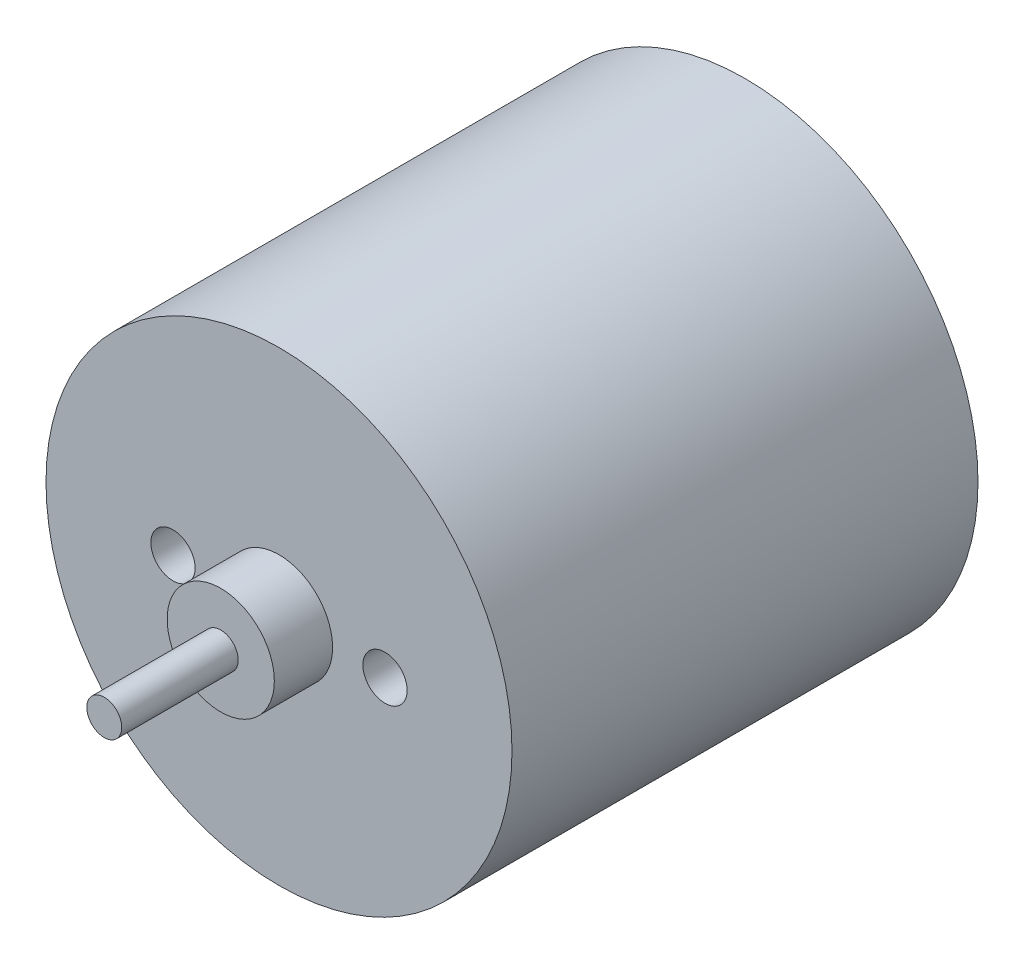
ISO-10303-21;
HEADER;
FILE_DESCRIPTION(('STEP AP214'),'2;1');
FILE_NAME('part.step','',(''),(''),'','','');
FILE_SCHEMA(('AUTOMOTIVE_DESIGN { 1 0 10303 214 1 1 1 1 }'));
ENDSEC;
DATA;
#1=APPLICATION_CONTEXT('core data for automotive mechanical design processes');
#2=APPLICATION_PROTOCOL_DEFINITION('international standard','automotive_design',2000,#1);
#3=PRODUCT_CONTEXT('',#1,'mechanical');
#4=PRODUCT('Part','Part','',(#3));
#5=PRODUCT_RELATED_PRODUCT_CATEGORY('part','',(#4));
#6=PRODUCT_DEFINITION_FORMATION('','',#4);
#7=PRODUCT_DEFINITION_CONTEXT('part definition',#1,'design');
#8=PRODUCT_DEFINITION('design','',#6,#7);
#9=PRODUCT_DEFINITION_SHAPE('','',#8);
#10=(LENGTH_UNIT() NAMED_UNIT(*) SI_UNIT(.MILLI.,.METRE.));
#11=(NAMED_UNIT(*) PLANE_ANGLE_UNIT() SI_UNIT($,.RADIAN.));
#12=(NAMED_UNIT(*) SI_UNIT($,.STERADIAN.) SOLID_ANGLE_UNIT());
#13=UNCERTAINTY_MEASURE_WITH_UNIT(LENGTH_MEASURE(1.E-05),#10,'distance_accuracy_value','');
#14=(GEOMETRIC_REPRESENTATION_CONTEXT(3) GLOBAL_UNCERTAINTY_ASSIGNED_CONTEXT((#13)) GLOBAL_UNIT_ASSIGNED_CONTEXT((#10,
#11,#12)) REPRESENTATION_CONTEXT('',''));
#15=CARTESIAN_POINT('',(0.,0.,0.));
#16=DIRECTION('',(0.,0.,1.));
#17=DIRECTION('',(1.,0.,0.));
#18=AXIS2_PLACEMENT_3D('',#15,#16,#17);
#19=CARTESIAN_POINT('',(0.,0.,25.4));
#20=DIRECTION('',(0.,0.,-1.));
#21=DIRECTION('',(-1.,0.,0.));
#22=AXIS2_PLACEMENT_3D('',#19,#20,#21);
#23=CYLINDRICAL_SURFACE('',#22,12.7);
#24=CARTESIAN_POINT('',(0.,0.,25.4));
#25=DIRECTION('',(0.,0.,1.));
#26=DIRECTION('',(1.,0.,0.));
#27=AXIS2_PLACEMENT_3D('',#24,#25,#26);
#28=CIRCLE('',#27,12.7);
#29=CARTESIAN_POINT('',(12.7,0.,25.4));
#30=VERTEX_POINT('',#29);
#31=EDGE_CURVE('E45',#30,#30,#28,.T.);
#32=ORIENTED_EDGE('',*,*,#31,.F.);
#33=EDGE_LOOP('',(#32));
#34=FACE_BOUND('',#33,.T.);
#35=CARTESIAN_POINT('',(0.,0.,0.));
#36=DIRECTION('',(0.,0.,1.));
#37=DIRECTION('',(1.,0.,0.));
#38=AXIS2_PLACEMENT_3D('',#35,#36,#37);
#39=CIRCLE('',#38,12.7);
#40=CARTESIAN_POINT('',(12.7,0.,0.));
#41=VERTEX_POINT('',#40);
#42=EDGE_CURVE('E36',#41,#41,#39,.T.);
#43=ORIENTED_EDGE('',*,*,#42,.T.);
#44=EDGE_LOOP('',(#43));
#45=FACE_BOUND('',#44,.T.);
#46=ADVANCED_FACE('F33',(#34,#45),#23,.T.);
#47=CARTESIAN_POINT('',(0.,0.,25.4));
#48=DIRECTION('',(0.,0.,1.));
#49=DIRECTION('',(1.,0.,0.));
#50=AXIS2_PLACEMENT_3D('',#47,#48,#49);
#51=PLANE('',#50);
#52=CARTESIAN_POINT('',(5.7785,0.,25.4));
#53=DIRECTION('',(0.,0.,1.));
#54=DIRECTION('',(1.,0.,0.));
#55=AXIS2_PLACEMENT_3D('',#52,#53,#54);
#56=CIRCLE('',#55,1.2065);
#57=CARTESIAN_POINT('',(6.985,0.,25.4));
#58=VERTEX_POINT('',#57);
#59=EDGE_CURVE('E54',#58,#58,#56,.T.);
#60=ORIENTED_EDGE('',*,*,#59,.F.);
#61=EDGE_LOOP('',(#60));
#62=FACE_BOUND('',#61,.T.);
#63=CARTESIAN_POINT('',(-5.7785,0.,25.4));
#64=DIRECTION('',(0.,0.,1.));
#65=DIRECTION('',(1.,0.,0.));
#66=AXIS2_PLACEMENT_3D('',#63,#64,#65);
#67=CIRCLE('',#66,1.2065);
#68=CARTESIAN_POINT('',(-4.572,0.,25.4));
#69=VERTEX_POINT('',#68);
#70=EDGE_CURVE('E57',#69,#69,#67,.T.);
#71=ORIENTED_EDGE('',*,*,#70,.F.);
#72=EDGE_LOOP('',(#71));
#73=FACE_BOUND('',#72,.T.);
#74=CARTESIAN_POINT('',(0.,0.,25.4));
#75=DIRECTION('',(0.,0.,1.));
#76=DIRECTION('',(1.,0.,0.));
#77=AXIS2_PLACEMENT_3D('',#74,#75,#76);
#78=CIRCLE('',#77,2.921);
#79=CARTESIAN_POINT('',(2.921,0.,25.4));
#80=VERTEX_POINT('',#79);
#81=EDGE_CURVE('E40',#80,#80,#78,.T.);
#82=ORIENTED_EDGE('',*,*,#81,.F.);
#83=EDGE_LOOP('',(#82));
#84=FACE_BOUND('',#83,.T.);
#85=ORIENTED_EDGE('',*,*,#31,.T.);
#86=EDGE_LOOP('',(#85));
#87=FACE_BOUND('',#86,.T.);
#88=ADVANCED_FACE('F74',(#62,#73,#84,#87),#51,.T.);
#89=CARTESIAN_POINT('',(0.,0.,0.));
#90=DIRECTION('',(0.,0.,1.));
#91=DIRECTION('',(1.,0.,0.));
#92=AXIS2_PLACEMENT_3D('',#89,#90,#91);
#93=PLANE('',#92);
#94=ORIENTED_EDGE('',*,*,#42,.F.);
#95=EDGE_LOOP('',(#94));
#96=FACE_BOUND('',#95,.T.);
#97=ADVANCED_FACE('F71',(#96),#93,.F.);
#98=CARTESIAN_POINT('',(0.,0.,28.575));
#99=DIRECTION('',(0.,0.,-1.));
#100=DIRECTION('',(-1.,0.,0.));
#101=AXIS2_PLACEMENT_3D('',#98,#99,#100);
#102=CYLINDRICAL_SURFACE('',#101,2.921);
#103=CARTESIAN_POINT('',(0.,0.,28.575));
#104=DIRECTION('',(0.,0.,1.));
#105=DIRECTION('',(1.,0.,0.));
#106=AXIS2_PLACEMENT_3D('',#103,#104,#105);
#107=CIRCLE('',#106,2.921);
#108=CARTESIAN_POINT('',(2.921,0.,28.575));
#109=VERTEX_POINT('',#108);
#110=EDGE_CURVE('E53',#109,#109,#107,.T.);
#111=ORIENTED_EDGE('',*,*,#110,.F.);
#112=EDGE_LOOP('',(#111));
#113=FACE_BOUND('',#112,.T.);
#114=ORIENTED_EDGE('',*,*,#81,.T.);
#115=EDGE_LOOP('',(#114));
#116=FACE_BOUND('',#115,.T.);
#117=ADVANCED_FACE('F73',(#113,#116),#102,.T.);
#118=CARTESIAN_POINT('',(0.,0.,28.575));
#119=DIRECTION('',(0.,0.,1.));
#120=DIRECTION('',(1.,0.,0.));
#121=AXIS2_PLACEMENT_3D('',#118,#119,#120);
#122=PLANE('',#121);
#123=CARTESIAN_POINT('',(0.,0.,28.575));
#124=DIRECTION('',(0.,0.,1.));
#125=DIRECTION('',(1.,0.,0.));
#126=AXIS2_PLACEMENT_3D('',#123,#124,#125);
#127=CIRCLE('',#126,0.9525);
#128=CARTESIAN_POINT('',(0.9525,0.,28.575));
#129=VERTEX_POINT('',#128);
#130=EDGE_CURVE('E10',#129,#129,#127,.T.);
#131=ORIENTED_EDGE('',*,*,#130,.F.);
#132=EDGE_LOOP('',(#131));
#133=FACE_BOUND('',#132,.T.);
#134=ORIENTED_EDGE('',*,*,#110,.T.);
#135=EDGE_LOOP('',(#134));
#136=FACE_BOUND('',#135,.T.);
#137=ADVANCED_FACE('F79',(#133,#136),#122,.T.);
#138=CARTESIAN_POINT('',(-5.7785,0.,17.78));
#139=DIRECTION('',(0.,0.,1.));
#140=DIRECTION('',(1.,0.,0.));
#141=AXIS2_PLACEMENT_3D('',#138,#139,#140);
#142=CYLINDRICAL_SURFACE('',#141,1.2065);
#143=CARTESIAN_POINT('',(-5.7785,0.,17.78));
#144=DIRECTION('',(0.,0.,1.));
#145=DIRECTION('',(1.,0.,0.));
#146=AXIS2_PLACEMENT_3D('',#143,#144,#145);
#147=CIRCLE('',#146,1.2065);
#148=CARTESIAN_POINT('',(-4.572,0.,17.78));
#149=VERTEX_POINT('',#148);
#150=EDGE_CURVE('E60',#149,#149,#147,.T.);
#151=ORIENTED_EDGE('',*,*,#150,.F.);
#152=EDGE_LOOP('',(#151));
#153=FACE_BOUND('',#152,.T.);
#154=ORIENTED_EDGE('',*,*,#70,.T.);
#155=EDGE_LOOP('',(#154));
#156=FACE_BOUND('',#155,.T.);
#157=ADVANCED_FACE('F101',(#153,#156),#142,.F.);
#158=CARTESIAN_POINT('',(-5.7785,0.,17.78));
#159=DIRECTION('',(0.,0.,1.));
#160=DIRECTION('',(1.,0.,0.));
#161=AXIS2_PLACEMENT_3D('',#158,#159,#160);
#162=PLANE('',#161);
#163=ORIENTED_EDGE('',*,*,#150,.T.);
#164=EDGE_LOOP('',(#163));
#165=FACE_BOUND('',#164,.T.);
#166=ADVANCED_FACE('F106',(#165),#162,.T.);
#167=CARTESIAN_POINT('',(5.7785,0.,17.78));
#168=DIRECTION('',(0.,0.,1.));
#169=DIRECTION('',(1.,0.,0.));
#170=AXIS2_PLACEMENT_3D('',#167,#168,#169);
#171=CYLINDRICAL_SURFACE('',#170,1.2065);
#172=CARTESIAN_POINT('',(5.7785,0.,17.78));
#173=DIRECTION('',(0.,0.,1.));
#174=DIRECTION('',(1.,0.,0.));
#175=AXIS2_PLACEMENT_3D('',#172,#173,#174);
#176=CIRCLE('',#175,1.2065);
#177=CARTESIAN_POINT('',(6.985,0.,17.78));
#178=VERTEX_POINT('',#177);
#179=EDGE_CURVE('E50',#178,#178,#176,.T.);
#180=ORIENTED_EDGE('',*,*,#179,.F.);
#181=EDGE_LOOP('',(#180));
#182=FACE_BOUND('',#181,.T.);
#183=ORIENTED_EDGE('',*,*,#59,.T.);
#184=EDGE_LOOP('',(#183));
#185=FACE_BOUND('',#184,.T.);
#186=ADVANCED_FACE('F118',(#182,#185),#171,.F.);
#187=CARTESIAN_POINT('',(5.7785,0.,17.78));
#188=DIRECTION('',(0.,0.,1.));
#189=DIRECTION('',(1.,0.,0.));
#190=AXIS2_PLACEMENT_3D('',#187,#188,#189);
#191=PLANE('',#190);
#192=ORIENTED_EDGE('',*,*,#179,.T.);
#193=EDGE_LOOP('',(#192));
#194=FACE_BOUND('',#193,.T.);
#195=ADVANCED_FACE('F128',(#194),#191,.T.);
#196=CARTESIAN_POINT('',(0.,0.,34.925));
#197=DIRECTION('',(0.,0.,-1.));
#198=DIRECTION('',(-1.,0.,0.));
#199=AXIS2_PLACEMENT_3D('',#196,#197,#198);
#200=CYLINDRICAL_SURFACE('',#199,0.9525);
#201=CARTESIAN_POINT('',(0.,0.,34.925));
#202=DIRECTION('',(0.,0.,1.));
#203=DIRECTION('',(1.,0.,0.));
#204=AXIS2_PLACEMENT_3D('',#201,#202,#203);
#205=CIRCLE('',#204,0.9525);
#206=CARTESIAN_POINT('',(0.9525,0.,34.925));
#207=VERTEX_POINT('',#206);
#208=EDGE_CURVE('E49',#207,#207,#205,.T.);
#209=ORIENTED_EDGE('',*,*,#208,.F.);
#210=EDGE_LOOP('',(#209));
#211=FACE_BOUND('',#210,.T.);
#212=ORIENTED_EDGE('',*,*,#130,.T.);
#213=EDGE_LOOP('',(#212));
#214=FACE_BOUND('',#213,.T.);
#215=ADVANCED_FACE('F138',(#211,#214),#200,.T.);
#216=CARTESIAN_POINT('',(0.,0.,34.925));
#217=DIRECTION('',(0.,0.,1.));
#218=DIRECTION('',(1.,0.,0.));
#219=AXIS2_PLACEMENT_3D('',#216,#217,#218);
#220=PLANE('',#219);
#221=ORIENTED_EDGE('',*,*,#208,.T.);
#222=EDGE_LOOP('',(#221));
#223=FACE_BOUND('',#222,.T.);
#224=ADVANCED_FACE('F155',(#223),#220,.T.);
#225=CLOSED_SHELL('',(#46,#88,#97,#117,#137,#157,#166,#186,#195,#215,#224));
#226=MANIFOLD_SOLID_BREP('B2',#225);
#227=ADVANCED_BREP_SHAPE_REPRESENTATION('',(#18,#226),#14);
#228=SHAPE_DEFINITION_REPRESENTATION(#9,#227);
ENDSEC;
END-ISO-10303-21;
